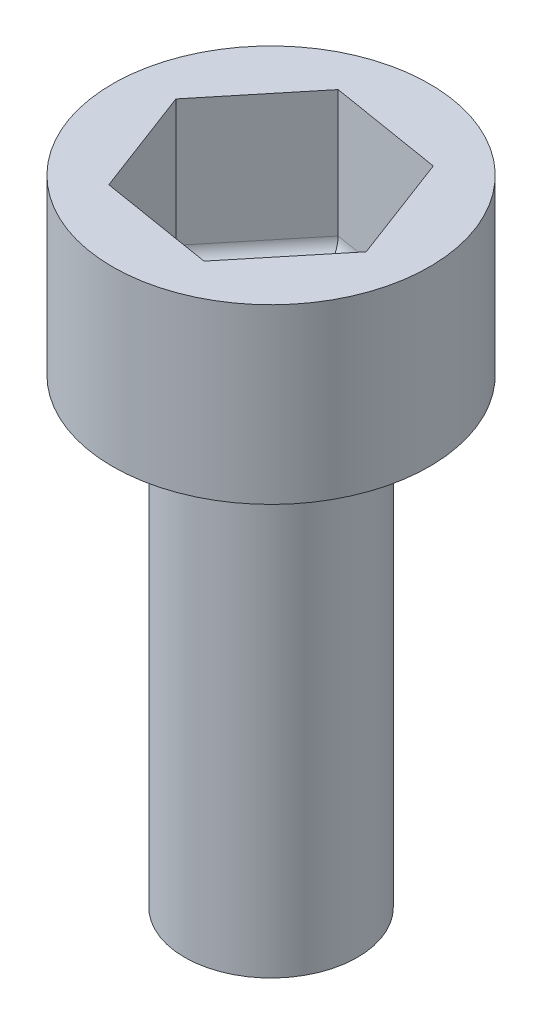
ISO-10303-21;
HEADER;
FILE_DESCRIPTION(('STEP AP214'),'2;1');
FILE_NAME('part.step','',(''),(''),'','','');
FILE_SCHEMA(('AUTOMOTIVE_DESIGN { 1 0 10303 214 1 1 1 1 }'));
ENDSEC;
DATA;
#1=APPLICATION_CONTEXT('core data for automotive mechanical design processes');
#2=APPLICATION_PROTOCOL_DEFINITION('international standard','automotive_design',2000,#1);
#3=PRODUCT_CONTEXT('',#1,'mechanical');
#4=PRODUCT('Part','Part','',(#3));
#5=PRODUCT_RELATED_PRODUCT_CATEGORY('part','',(#4));
#6=PRODUCT_DEFINITION_FORMATION('','',#4);
#7=PRODUCT_DEFINITION_CONTEXT('part definition',#1,'design');
#8=PRODUCT_DEFINITION('design','',#6,#7);
#9=PRODUCT_DEFINITION_SHAPE('','',#8);
#10=(LENGTH_UNIT() NAMED_UNIT(*) SI_UNIT(.MILLI.,.METRE.));
#11=(NAMED_UNIT(*) PLANE_ANGLE_UNIT() SI_UNIT($,.RADIAN.));
#12=(NAMED_UNIT(*) SI_UNIT($,.STERADIAN.) SOLID_ANGLE_UNIT());
#13=UNCERTAINTY_MEASURE_WITH_UNIT(LENGTH_MEASURE(1.E-05),#10,'distance_accuracy_value','');
#14=(GEOMETRIC_REPRESENTATION_CONTEXT(3) GLOBAL_UNCERTAINTY_ASSIGNED_CONTEXT((#13)) GLOBAL_UNIT_ASSIGNED_CONTEXT((#10,
#11,#12)) REPRESENTATION_CONTEXT('',''));
#15=CARTESIAN_POINT('',(0.,0.,0.));
#16=DIRECTION('',(0.,0.,1.));
#17=DIRECTION('',(1.,0.,0.));
#18=AXIS2_PLACEMENT_3D('',#15,#16,#17);
#19=CARTESIAN_POINT('',(0.,8.,0.));
#20=DIRECTION('',(0.,-1.,0.));
#21=DIRECTION('',(0.,0.,-1.));
#22=AXIS2_PLACEMENT_3D('',#19,#20,#21);
#23=CYLINDRICAL_SURFACE('',#22,1.5);
#24=CARTESIAN_POINT('',(0.,8.,0.));
#25=DIRECTION('',(0.,1.,0.));
#26=DIRECTION('',(0.,0.,1.));
#27=AXIS2_PLACEMENT_3D('',#24,#25,#26);
#28=CIRCLE('',#27,1.5);
#29=CARTESIAN_POINT('',(0.,8.,1.5));
#30=VERTEX_POINT('',#29);
#31=EDGE_CURVE('E172',#30,#30,#28,.T.);
#32=ORIENTED_EDGE('',*,*,#31,.F.);
#33=EDGE_LOOP('',(#32));
#34=FACE_BOUND('',#33,.T.);
#35=CARTESIAN_POINT('',(0.,0.,0.));
#36=DIRECTION('',(0.,1.,0.));
#37=DIRECTION('',(0.,0.,1.));
#38=AXIS2_PLACEMENT_3D('',#35,#36,#37);
#39=CIRCLE('',#38,1.5);
#40=CARTESIAN_POINT('',(0.,0.,1.5));
#41=VERTEX_POINT('',#40);
#42=EDGE_CURVE('E168',#41,#41,#39,.T.);
#43=ORIENTED_EDGE('',*,*,#42,.T.);
#44=EDGE_LOOP('',(#43));
#45=FACE_BOUND('',#44,.T.);
#46=ADVANCED_FACE('F39',(#34,#45),#23,.T.);
#47=CARTESIAN_POINT('',(0.,0.,0.));
#48=DIRECTION('',(0.,1.,0.));
#49=DIRECTION('',(0.,0.,1.));
#50=AXIS2_PLACEMENT_3D('',#47,#48,#49);
#51=PLANE('',#50);
#52=ORIENTED_EDGE('',*,*,#42,.F.);
#53=EDGE_LOOP('',(#52));
#54=FACE_BOUND('',#53,.T.);
#55=ADVANCED_FACE('F279',(#54),#51,.F.);
#56=CARTESIAN_POINT('',(0.,11.,0.));
#57=DIRECTION('',(0.,-1.,0.));
#58=DIRECTION('',(0.,0.,-1.));
#59=AXIS2_PLACEMENT_3D('',#56,#57,#58);
#60=CYLINDRICAL_SURFACE('',#59,2.75);
#61=CARTESIAN_POINT('',(0.,11.,0.));
#62=DIRECTION('',(0.,1.,0.));
#63=DIRECTION('',(0.,0.,1.));
#64=AXIS2_PLACEMENT_3D('',#61,#62,#63);
#65=CIRCLE('',#64,2.75);
#66=CARTESIAN_POINT('',(0.,11.,2.75));
#67=VERTEX_POINT('',#66);
#68=EDGE_CURVE('E164',#67,#67,#65,.T.);
#69=ORIENTED_EDGE('',*,*,#68,.F.);
#70=EDGE_LOOP('',(#69));
#71=FACE_BOUND('',#70,.T.);
#72=CARTESIAN_POINT('',(0.,8.,0.));
#73=DIRECTION('',(0.,1.,0.));
#74=DIRECTION('',(0.,0.,1.));
#75=AXIS2_PLACEMENT_3D('',#72,#73,#74);
#76=CIRCLE('',#75,2.75);
#77=CARTESIAN_POINT('',(0.,8.,2.75));
#78=VERTEX_POINT('',#77);
#79=EDGE_CURVE('E153',#78,#78,#76,.T.);
#80=ORIENTED_EDGE('',*,*,#79,.T.);
#81=EDGE_LOOP('',(#80));
#82=FACE_BOUND('',#81,.T.);
#83=ADVANCED_FACE('F285',(#71,#82),#60,.T.);
#84=CARTESIAN_POINT('',(0.,11.,0.));
#85=DIRECTION('',(0.,1.,0.));
#86=DIRECTION('',(0.,0.,1.));
#87=AXIS2_PLACEMENT_3D('',#84,#85,#86);
#88=PLANE('',#87);
#89=DIRECTION('',(0.633330898710843,0.,-0.773881110208872));
#90=VECTOR('',#89,1.);
#91=CARTESIAN_POINT('',(0.707070503188731,11.,1.87084240477931));
#92=LINE('',#91,#90);
#93=CARTESIAN_POINT('',(0.707070503188731,11.,1.87084240477931));
#94=VERTEX_POINT('',#93);
#95=CARTESIAN_POINT('',(1.97373230061042,11.,0.323080184361567));
#96=VERTEX_POINT('',#95);
#97=EDGE_CURVE('E129',#94,#96,#92,.T.);
#98=ORIENTED_EDGE('',*,*,#97,.F.);
#99=DIRECTION('',(0.986866150305209,0.,0.161540092180784));
#100=VECTOR('',#99,1.);
#101=CARTESIAN_POINT('',(-1.26666179742169,11.,1.54776222041774));
#102=LINE('',#101,#100);
#103=CARTESIAN_POINT('',(-1.26666179742169,11.,1.54776222041774));
#104=VERTEX_POINT('',#103);
#105=EDGE_CURVE('E146',#104,#94,#102,.T.);
#106=ORIENTED_EDGE('',*,*,#105,.F.);
#107=DIRECTION('',(0.353535251594366,0.,0.935421202389655));
#108=VECTOR('',#107,1.);
#109=CARTESIAN_POINT('',(-1.97373230061042,11.,-0.323080184361566));
#110=LINE('',#109,#108);
#111=CARTESIAN_POINT('',(-1.97373230061042,11.,-0.323080184361566));
#112=VERTEX_POINT('',#111);
#113=EDGE_CURVE('E139',#112,#104,#110,.T.);
#114=ORIENTED_EDGE('',*,*,#113,.F.);
#115=DIRECTION('',(-0.633330898710843,0.,0.773881110208872));
#116=VECTOR('',#115,1.);
#117=CARTESIAN_POINT('',(-0.707070503188731,11.,-1.87084240477931));
#118=LINE('',#117,#116);
#119=CARTESIAN_POINT('',(-0.707070503188731,11.,-1.87084240477931));
#120=VERTEX_POINT('',#119);
#121=EDGE_CURVE('E135',#120,#112,#118,.T.);
#122=ORIENTED_EDGE('',*,*,#121,.F.);
#123=DIRECTION('',(-0.986866150305209,0.,-0.161540092180784));
#124=VECTOR('',#123,1.);
#125=CARTESIAN_POINT('',(1.26666179742169,11.,-1.54776222041774));
#126=LINE('',#125,#124);
#127=CARTESIAN_POINT('',(1.26666179742169,11.,-1.54776222041774));
#128=VERTEX_POINT('',#127);
#129=EDGE_CURVE('E113',#128,#120,#126,.T.);
#130=ORIENTED_EDGE('',*,*,#129,.F.);
#131=DIRECTION('',(-0.353535251594366,0.,-0.935421202389655));
#132=VECTOR('',#131,1.);
#133=CARTESIAN_POINT('',(1.97373230061042,11.,0.323080184361567));
#134=LINE('',#133,#132);
#135=EDGE_CURVE('E122',#96,#128,#134,.T.);
#136=ORIENTED_EDGE('',*,*,#135,.F.);
#137=EDGE_LOOP('',(#98,#106,#114,#122,#130,#136));
#138=FACE_BOUND('',#137,.T.);
#139=ORIENTED_EDGE('',*,*,#68,.T.);
#140=EDGE_LOOP('',(#139));
#141=FACE_BOUND('',#140,.T.);
#142=ADVANCED_FACE('F131',(#138,#141),#88,.T.);
#143=CARTESIAN_POINT('',(0.,8.,0.));
#144=DIRECTION('',(0.,1.,0.));
#145=DIRECTION('',(0.,0.,1.));
#146=AXIS2_PLACEMENT_3D('',#143,#144,#145);
#147=PLANE('',#146);
#148=ORIENTED_EDGE('',*,*,#31,.T.);
#149=EDGE_LOOP('',(#148));
#150=FACE_BOUND('',#149,.T.);
#151=ORIENTED_EDGE('',*,*,#79,.F.);
#152=EDGE_LOOP('',(#151));
#153=FACE_BOUND('',#152,.T.);
#154=ADVANCED_FACE('F378',(#150,#153),#147,.F.);
#155=CARTESIAN_POINT('',(0.707070503188731,8.5,1.87084240477931));
#156=DIRECTION('',(0.773881110208872,0.,0.633330898710843));
#157=DIRECTION('',(0.633330898710843,0.,-0.773881110208872));
#158=AXIS2_PLACEMENT_3D('',#155,#156,#157);
#159=PLANE('',#158);
#160=DIRECTION('',(0.,1.,0.));
#161=VECTOR('',#160,1.);
#162=CARTESIAN_POINT('',(1.97373230061042,8.5,0.323080184361567));
#163=LINE('',#162,#161);
#164=CARTESIAN_POINT('',(1.97373230061042,8.8,0.323080184361567));
#165=VERTEX_POINT('',#164);
#166=EDGE_CURVE('E119',#165,#96,#163,.T.);
#167=ORIENTED_EDGE('',*,*,#166,.F.);
#168=DIRECTION('',(0.633330898710843,0.,-0.773881110208872));
#169=VECTOR('',#168,1.);
#170=CARTESIAN_POINT('',(0.707070503188731,8.8,1.87084240477931));
#171=LINE('',#170,#169);
#172=CARTESIAN_POINT('',(0.707070503188731,8.8,1.87084240477931));
#173=VERTEX_POINT('',#172);
#174=EDGE_CURVE('E198',#165,#173,#171,.F.);
#175=ORIENTED_EDGE('',*,*,#174,.T.);
#176=DIRECTION('',(0.,1.,0.));
#177=VECTOR('',#176,1.);
#178=CARTESIAN_POINT('',(0.707070503188731,8.5,1.87084240477931));
#179=LINE('',#178,#177);
#180=EDGE_CURVE('E150',#173,#94,#179,.T.);
#181=ORIENTED_EDGE('',*,*,#180,.T.);
#182=ORIENTED_EDGE('',*,*,#97,.T.);
#183=EDGE_LOOP('',(#167,#175,#181,#182));
#184=FACE_BOUND('',#183,.T.);
#185=ADVANCED_FACE('F240',(#184),#159,.F.);
#186=CARTESIAN_POINT('',(-1.26666179742169,8.5,1.54776222041774));
#187=DIRECTION('',(-0.161540092180784,0.,0.986866150305209));
#188=DIRECTION('',(0.986866150305209,0.,0.161540092180784));
#189=AXIS2_PLACEMENT_3D('',#186,#187,#188);
#190=PLANE('',#189);
#191=ORIENTED_EDGE('',*,*,#180,.F.);
#192=DIRECTION('',(0.986866150305209,0.,0.161540092180784));
#193=VECTOR('',#192,1.);
#194=CARTESIAN_POINT('',(-1.26666179742169,8.8,1.54776222041774));
#195=LINE('',#194,#193);
#196=CARTESIAN_POINT('',(-1.26666179742169,8.8,1.54776222041774));
#197=VERTEX_POINT('',#196);
#198=EDGE_CURVE('E202',#173,#197,#195,.F.);
#199=ORIENTED_EDGE('',*,*,#198,.T.);
#200=DIRECTION('',(0.,1.,0.));
#201=VECTOR('',#200,1.);
#202=CARTESIAN_POINT('',(-1.26666179742169,8.5,1.54776222041774));
#203=LINE('',#202,#201);
#204=EDGE_CURVE('E154',#197,#104,#203,.T.);
#205=ORIENTED_EDGE('',*,*,#204,.T.);
#206=ORIENTED_EDGE('',*,*,#105,.T.);
#207=EDGE_LOOP('',(#191,#199,#205,#206));
#208=FACE_BOUND('',#207,.T.);
#209=ADVANCED_FACE('F245',(#208),#190,.F.);
#210=CARTESIAN_POINT('',(-1.97373230061042,8.5,-0.323080184361566));
#211=DIRECTION('',(-0.935421202389655,0.,0.353535251594366));
#212=DIRECTION('',(0.353535251594366,0.,0.935421202389655));
#213=AXIS2_PLACEMENT_3D('',#210,#211,#212);
#214=PLANE('',#213);
#215=ORIENTED_EDGE('',*,*,#204,.F.);
#216=DIRECTION('',(0.353535251594366,0.,0.935421202389655));
#217=VECTOR('',#216,1.);
#218=CARTESIAN_POINT('',(-1.97373230061042,8.8,-0.323080184361566));
#219=LINE('',#218,#217);
#220=CARTESIAN_POINT('',(-1.97373230061042,8.8,-0.323080184361566));
#221=VERTEX_POINT('',#220);
#222=EDGE_CURVE('E205',#197,#221,#219,.F.);
#223=ORIENTED_EDGE('',*,*,#222,.T.);
#224=DIRECTION('',(0.,1.,0.));
#225=VECTOR('',#224,1.);
#226=CARTESIAN_POINT('',(-1.97373230061042,8.5,-0.323080184361566));
#227=LINE('',#226,#225);
#228=EDGE_CURVE('E157',#221,#112,#227,.T.);
#229=ORIENTED_EDGE('',*,*,#228,.T.);
#230=ORIENTED_EDGE('',*,*,#113,.T.);
#231=EDGE_LOOP('',(#215,#223,#229,#230));
#232=FACE_BOUND('',#231,.T.);
#233=ADVANCED_FACE('F249',(#232),#214,.F.);
#234=CARTESIAN_POINT('',(-0.707070503188731,8.5,-1.87084240477931));
#235=DIRECTION('',(-0.773881110208872,0.,-0.633330898710843));
#236=DIRECTION('',(-0.633330898710843,0.,0.773881110208872));
#237=AXIS2_PLACEMENT_3D('',#234,#235,#236);
#238=PLANE('',#237);
#239=ORIENTED_EDGE('',*,*,#228,.F.);
#240=DIRECTION('',(-0.633330898710843,0.,0.773881110208872));
#241=VECTOR('',#240,1.);
#242=CARTESIAN_POINT('',(-0.707070503188731,8.8,-1.87084240477931));
#243=LINE('',#242,#241);
#244=CARTESIAN_POINT('',(-0.707070503188731,8.8,-1.87084240477931));
#245=VERTEX_POINT('',#244);
#246=EDGE_CURVE('E49',#221,#245,#243,.F.);
#247=ORIENTED_EDGE('',*,*,#246,.T.);
#248=DIRECTION('',(0.,1.,0.));
#249=VECTOR('',#248,1.);
#250=CARTESIAN_POINT('',(-0.707070503188731,8.5,-1.87084240477931));
#251=LINE('',#250,#249);
#252=EDGE_CURVE('E118',#245,#120,#251,.T.);
#253=ORIENTED_EDGE('',*,*,#252,.T.);
#254=ORIENTED_EDGE('',*,*,#121,.T.);
#255=EDGE_LOOP('',(#239,#247,#253,#254));
#256=FACE_BOUND('',#255,.T.);
#257=ADVANCED_FACE('F250',(#256),#238,.F.);
#258=CARTESIAN_POINT('',(1.26666179742169,8.5,-1.54776222041774));
#259=DIRECTION('',(0.161540092180784,0.,-0.986866150305209));
#260=DIRECTION('',(-0.986866150305209,0.,-0.161540092180784));
#261=AXIS2_PLACEMENT_3D('',#258,#259,#260);
#262=PLANE('',#261);
#263=ORIENTED_EDGE('',*,*,#252,.F.);
#264=DIRECTION('',(-0.986866150305209,0.,-0.161540092180784));
#265=VECTOR('',#264,1.);
#266=CARTESIAN_POINT('',(1.26666179742169,8.8,-1.54776222041774));
#267=LINE('',#266,#265);
#268=CARTESIAN_POINT('',(1.26666179742169,8.8,-1.54776222041774));
#269=VERTEX_POINT('',#268);
#270=EDGE_CURVE('E11',#245,#269,#267,.F.);
#271=ORIENTED_EDGE('',*,*,#270,.T.);
#272=DIRECTION('',(0.,1.,0.));
#273=VECTOR('',#272,1.);
#274=CARTESIAN_POINT('',(1.26666179742169,8.5,-1.54776222041774));
#275=LINE('',#274,#273);
#276=EDGE_CURVE('E109',#269,#128,#275,.T.);
#277=ORIENTED_EDGE('',*,*,#276,.T.);
#278=ORIENTED_EDGE('',*,*,#129,.T.);
#279=EDGE_LOOP('',(#263,#271,#277,#278));
#280=FACE_BOUND('',#279,.T.);
#281=ADVANCED_FACE('F111',(#280),#262,.F.);
#282=CARTESIAN_POINT('',(1.97373230061042,8.5,0.323080184361567));
#283=DIRECTION('',(0.935421202389655,0.,-0.353535251594366));
#284=DIRECTION('',(-0.353535251594366,0.,-0.935421202389655));
#285=AXIS2_PLACEMENT_3D('',#282,#283,#284);
#286=PLANE('',#285);
#287=ORIENTED_EDGE('',*,*,#276,.F.);
#288=DIRECTION('',(-0.353535251594366,0.,-0.935421202389655));
#289=VECTOR('',#288,1.);
#290=CARTESIAN_POINT('',(1.97373230061042,8.8,0.323080184361567));
#291=LINE('',#290,#289);
#292=EDGE_CURVE('E208',#269,#165,#291,.F.);
#293=ORIENTED_EDGE('',*,*,#292,.T.);
#294=ORIENTED_EDGE('',*,*,#166,.T.);
#295=ORIENTED_EDGE('',*,*,#135,.T.);
#296=EDGE_LOOP('',(#287,#293,#294,#295));
#297=FACE_BOUND('',#296,.T.);
#298=ADVANCED_FACE('F123',(#297),#286,.F.);
#299=CARTESIAN_POINT('',(0.,8.5,0.));
#300=DIRECTION('',(0.,1.,0.));
#301=DIRECTION('',(0.,0.,1.));
#302=AXIS2_PLACEMENT_3D('',#299,#300,#301);
#303=PLANE('',#302);
#304=DIRECTION('',(0.986866150305209,0.,0.161540092180784));
#305=VECTOR('',#304,1.);
#306=CARTESIAN_POINT('',(-0.231333619462243,8.5,1.41324246750696));
#307=LINE('',#306,#305);
#308=CARTESIAN_POINT('',(-1.0472695385076,8.5,1.27968194003783));
#309=VERTEX_POINT('',#308);
#310=CARTESIAN_POINT('',(0.584602299583114,8.5,1.5468029949761));
#311=VERTEX_POINT('',#310);
#312=EDGE_CURVE('E191',#309,#311,#307,.T.);
#313=ORIENTED_EDGE('',*,*,#312,.T.);
#314=DIRECTION('',(0.633330898710843,0.,-0.773881110208872));
#315=VECTOR('',#314,1.);
#316=CARTESIAN_POINT('',(1.10823706883691,8.5,0.906962024957186));
#317=LINE('',#316,#315);
#318=CARTESIAN_POINT('',(1.63187183809071,8.5,0.267121054938272));
#319=VERTEX_POINT('',#318);
#320=EDGE_CURVE('E194',#311,#319,#317,.T.);
#321=ORIENTED_EDGE('',*,*,#320,.T.);
#322=DIRECTION('',(-0.353535251594366,0.,-0.935421202389655));
#323=VECTOR('',#322,1.);
#324=CARTESIAN_POINT('',(1.33957068829916,8.5,-0.506280442549778));
#325=LINE('',#324,#323);
#326=CARTESIAN_POINT('',(1.0472695385076,8.5,-1.27968194003783));
#327=VERTEX_POINT('',#326);
#328=EDGE_CURVE('E185',#319,#327,#325,.T.);
#329=ORIENTED_EDGE('',*,*,#328,.T.);
#330=DIRECTION('',(-0.986866150305209,0.,-0.161540092180784));
#331=VECTOR('',#330,1.);
#332=CARTESIAN_POINT('',(0.231333619462242,8.5,-1.41324246750696));
#333=LINE('',#332,#331);
#334=CARTESIAN_POINT('',(-0.584602299583114,8.5,-1.5468029949761));
#335=VERTEX_POINT('',#334);
#336=EDGE_CURVE('E176',#327,#335,#333,.T.);
#337=ORIENTED_EDGE('',*,*,#336,.T.);
#338=DIRECTION('',(-0.633330898710843,0.,0.773881110208872));
#339=VECTOR('',#338,1.);
#340=CARTESIAN_POINT('',(-1.10823706883691,8.5,-0.906962024957185));
#341=LINE('',#340,#339);
#342=CARTESIAN_POINT('',(-1.63187183809071,8.5,-0.267121054938271));
#343=VERTEX_POINT('',#342);
#344=EDGE_CURVE('E182',#335,#343,#341,.T.);
#345=ORIENTED_EDGE('',*,*,#344,.T.);
#346=DIRECTION('',(0.353535251594366,0.,0.935421202389655));
#347=VECTOR('',#346,1.);
#348=CARTESIAN_POINT('',(-1.33957068829916,8.5,0.506280442549778));
#349=LINE('',#348,#347);
#350=EDGE_CURVE('E188',#343,#309,#349,.T.);
#351=ORIENTED_EDGE('',*,*,#350,.T.);
#352=EDGE_LOOP('',(#313,#321,#329,#337,#345,#351));
#353=FACE_BOUND('',#352,.T.);
#354=ADVANCED_FACE('F269',(#353),#303,.T.);
#355=CARTESIAN_POINT('',(-1.10823706883691,8.8,-0.906962024957185));
#356=DIRECTION('',(-0.633330898710843,0.,0.773881110208872));
#357=DIRECTION('',(0.773881110208872,0.,0.633330898710843));
#358=AXIS2_PLACEMENT_3D('',#355,#356,#357);
#359=CYLINDRICAL_SURFACE('',#358,0.3);
#360=CARTESIAN_POINT('',(-0.584602299583113,8.8,-1.5468029949761));
#361=DIRECTION('',(-0.935421202389655,0.,0.353535251594366));
#362=DIRECTION('',(0.353535251594366,0.,0.935421202389655));
#363=AXIS2_PLACEMENT_3D('',#360,#361,#362);
#364=ELLIPSE('',#363,0.346410161513776,0.3);
#365=EDGE_CURVE('E226',#245,#335,#364,.T.);
#366=ORIENTED_EDGE('',*,*,#365,.F.);
#367=ORIENTED_EDGE('',*,*,#246,.F.);
#368=CARTESIAN_POINT('',(-1.63187183809071,8.8,-0.267121054938271));
#369=DIRECTION('',(-0.161540092180784,0.,0.986866150305209));
#370=DIRECTION('',(0.986866150305209,0.,0.161540092180784));
#371=AXIS2_PLACEMENT_3D('',#368,#369,#370);
#372=ELLIPSE('',#371,0.346410161513775,0.3);
#373=EDGE_CURVE('E43',#343,#221,#372,.F.);
#374=ORIENTED_EDGE('',*,*,#373,.F.);
#375=ORIENTED_EDGE('',*,*,#344,.F.);
#376=EDGE_LOOP('',(#366,#367,#374,#375));
#377=FACE_BOUND('',#376,.T.);
#378=ADVANCED_FACE('F41',(#377),#359,.F.);
#379=CARTESIAN_POINT('',(-1.33957068829916,8.8,0.506280442549778));
#380=DIRECTION('',(0.353535251594366,0.,0.935421202389655));
#381=DIRECTION('',(0.935421202389655,0.,-0.353535251594366));
#382=AXIS2_PLACEMENT_3D('',#379,#380,#381);
#383=CYLINDRICAL_SURFACE('',#382,0.3);
#384=ORIENTED_EDGE('',*,*,#373,.T.);
#385=ORIENTED_EDGE('',*,*,#222,.F.);
#386=CARTESIAN_POINT('',(-1.0472695385076,8.8,1.27968194003783));
#387=DIRECTION('',(0.773881110208871,0.,0.633330898710844));
#388=DIRECTION('',(0.633330898710843,0.,-0.773881110208871));
#389=AXIS2_PLACEMENT_3D('',#386,#387,#388);
#390=ELLIPSE('',#389,0.346410161513775,0.3);
#391=EDGE_CURVE('E223',#309,#197,#390,.F.);
#392=ORIENTED_EDGE('',*,*,#391,.F.);
#393=ORIENTED_EDGE('',*,*,#350,.F.);
#394=EDGE_LOOP('',(#384,#385,#392,#393));
#395=FACE_BOUND('',#394,.T.);
#396=ADVANCED_FACE('F267',(#395),#383,.F.);
#397=CARTESIAN_POINT('',(0.231333619462242,8.8,-1.41324246750696));
#398=DIRECTION('',(-0.986866150305209,0.,-0.161540092180784));
#399=DIRECTION('',(-0.161540092180784,0.,0.986866150305209));
#400=AXIS2_PLACEMENT_3D('',#397,#398,#399);
#401=CYLINDRICAL_SURFACE('',#400,0.3);
#402=ORIENTED_EDGE('',*,*,#365,.T.);
#403=ORIENTED_EDGE('',*,*,#336,.F.);
#404=CARTESIAN_POINT('',(1.0472695385076,8.8,-1.27968194003783));
#405=DIRECTION('',(-0.773881110208872,0.,-0.633330898710843));
#406=DIRECTION('',(0.633330898710843,0.,-0.773881110208872));
#407=AXIS2_PLACEMENT_3D('',#404,#405,#406);
#408=ELLIPSE('',#407,0.346410161513775,0.3);
#409=EDGE_CURVE('E219',#269,#327,#408,.T.);
#410=ORIENTED_EDGE('',*,*,#409,.F.);
#411=ORIENTED_EDGE('',*,*,#270,.F.);
#412=EDGE_LOOP('',(#402,#403,#410,#411));
#413=FACE_BOUND('',#412,.T.);
#414=ADVANCED_FACE('F253',(#413),#401,.F.);
#415=CARTESIAN_POINT('',(-0.231333619462243,8.8,1.41324246750696));
#416=DIRECTION('',(0.986866150305209,0.,0.161540092180784));
#417=DIRECTION('',(0.161540092180784,0.,-0.986866150305209));
#418=AXIS2_PLACEMENT_3D('',#415,#416,#417);
#419=CYLINDRICAL_SURFACE('',#418,0.3);
#420=ORIENTED_EDGE('',*,*,#391,.T.);
#421=ORIENTED_EDGE('',*,*,#198,.F.);
#422=CARTESIAN_POINT('',(0.584602299583114,8.8,1.5468029949761));
#423=DIRECTION('',(0.935421202389655,0.,-0.353535251594366));
#424=DIRECTION('',(-0.353535251594366,0.,-0.935421202389655));
#425=AXIS2_PLACEMENT_3D('',#422,#423,#424);
#426=ELLIPSE('',#425,0.346410161513776,0.3);
#427=EDGE_CURVE('E216',#311,#173,#426,.F.);
#428=ORIENTED_EDGE('',*,*,#427,.F.);
#429=ORIENTED_EDGE('',*,*,#312,.F.);
#430=EDGE_LOOP('',(#420,#421,#428,#429));
#431=FACE_BOUND('',#430,.T.);
#432=ADVANCED_FACE('F265',(#431),#419,.F.);
#433=CARTESIAN_POINT('',(1.33957068829916,8.8,-0.506280442549778));
#434=DIRECTION('',(-0.353535251594366,0.,-0.935421202389655));
#435=DIRECTION('',(-0.935421202389655,0.,0.353535251594366));
#436=AXIS2_PLACEMENT_3D('',#433,#434,#435);
#437=CYLINDRICAL_SURFACE('',#436,0.3);
#438=ORIENTED_EDGE('',*,*,#409,.T.);
#439=ORIENTED_EDGE('',*,*,#328,.F.);
#440=CARTESIAN_POINT('',(1.63187183809071,8.8,0.267121054938272));
#441=DIRECTION('',(0.161540092180784,0.,-0.986866150305209));
#442=DIRECTION('',(0.986866150305209,0.,0.161540092180784));
#443=AXIS2_PLACEMENT_3D('',#440,#441,#442);
#444=ELLIPSE('',#443,0.346410161513775,0.3);
#445=EDGE_CURVE('E213',#165,#319,#444,.T.);
#446=ORIENTED_EDGE('',*,*,#445,.F.);
#447=ORIENTED_EDGE('',*,*,#292,.F.);
#448=EDGE_LOOP('',(#438,#439,#446,#447));
#449=FACE_BOUND('',#448,.T.);
#450=ADVANCED_FACE('F258',(#449),#437,.F.);
#451=CARTESIAN_POINT('',(1.10823706883691,8.8,0.906962024957186));
#452=DIRECTION('',(0.633330898710843,0.,-0.773881110208872));
#453=DIRECTION('',(-0.773881110208872,0.,-0.633330898710843));
#454=AXIS2_PLACEMENT_3D('',#451,#452,#453);
#455=CYLINDRICAL_SURFACE('',#454,0.3);
#456=ORIENTED_EDGE('',*,*,#427,.T.);
#457=ORIENTED_EDGE('',*,*,#174,.F.);
#458=ORIENTED_EDGE('',*,*,#445,.T.);
#459=ORIENTED_EDGE('',*,*,#320,.F.);
#460=EDGE_LOOP('',(#456,#457,#458,#459));
#461=FACE_BOUND('',#460,.T.);
#462=ADVANCED_FACE('F261',(#461),#455,.F.);
#463=CLOSED_SHELL('',(#46,#55,#83,#142,#154,#185,#209,#233,#257,#281,#298,#354,#378,#396,#414,
#432,#450,#462));
#464=MANIFOLD_SOLID_BREP('B2',#463);
#465=ADVANCED_BREP_SHAPE_REPRESENTATION('',(#18,#464),#14);
#466=SHAPE_DEFINITION_REPRESENTATION(#9,#465);
ENDSEC;
END-ISO-10303-21;
